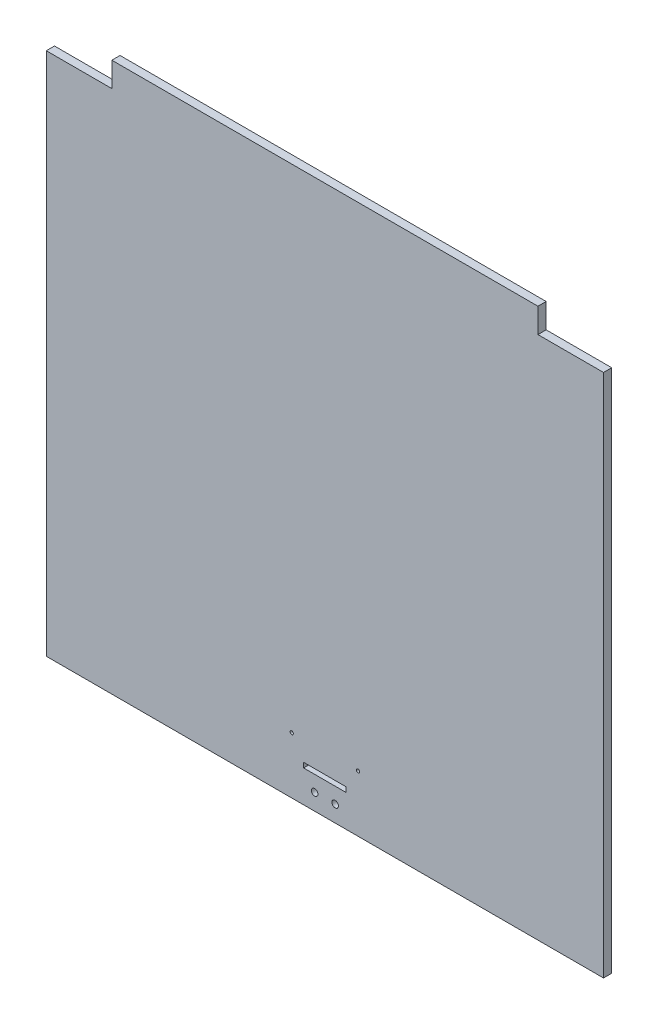
ISO-10303-21;
HEADER;
FILE_DESCRIPTION(('STEP AP214'),'2;1');
FILE_NAME('part.step','',(''),(''),'','','');
FILE_SCHEMA(('AUTOMOTIVE_DESIGN { 1 0 10303 214 1 1 1 1 }'));
ENDSEC;
DATA;
#1=APPLICATION_CONTEXT('core data for automotive mechanical design processes');
#2=APPLICATION_PROTOCOL_DEFINITION('international standard','automotive_design',2000,#1);
#3=PRODUCT_CONTEXT('',#1,'mechanical');
#4=PRODUCT('Part','Part','',(#3));
#5=PRODUCT_RELATED_PRODUCT_CATEGORY('part','',(#4));
#6=PRODUCT_DEFINITION_FORMATION('','',#4);
#7=PRODUCT_DEFINITION_CONTEXT('part definition',#1,'design');
#8=PRODUCT_DEFINITION('design','',#6,#7);
#9=PRODUCT_DEFINITION_SHAPE('','',#8);
#10=(LENGTH_UNIT() NAMED_UNIT(*) SI_UNIT(.MILLI.,.METRE.));
#11=(NAMED_UNIT(*) PLANE_ANGLE_UNIT() SI_UNIT($,.RADIAN.));
#12=(NAMED_UNIT(*) SI_UNIT($,.STERADIAN.) SOLID_ANGLE_UNIT());
#13=UNCERTAINTY_MEASURE_WITH_UNIT(LENGTH_MEASURE(1.E-05),#10,'distance_accuracy_value','');
#14=(GEOMETRIC_REPRESENTATION_CONTEXT(3) GLOBAL_UNCERTAINTY_ASSIGNED_CONTEXT((#13)) GLOBAL_UNIT_ASSIGNED_CONTEXT((#10,
#11,#12)) REPRESENTATION_CONTEXT('',''));
#15=CARTESIAN_POINT('',(0.,0.,0.));
#16=DIRECTION('',(0.,0.,1.));
#17=DIRECTION('',(1.,0.,0.));
#18=AXIS2_PLACEMENT_3D('',#15,#16,#17);
#19=CARTESIAN_POINT('',(-340.,335.,10.));
#20=DIRECTION('',(1.,0.,0.));
#21=DIRECTION('',(0.,1.,0.));
#22=AXIS2_PLACEMENT_3D('',#19,#20,#21);
#23=PLANE('',#22);
#24=DIRECTION('',(0.,-1.,0.));
#25=VECTOR('',#24,1.);
#26=CARTESIAN_POINT('',(-340.,335.,10.));
#27=LINE('',#26,#25);
#28=CARTESIAN_POINT('',(-340.,305.,10.));
#29=VERTEX_POINT('',#28);
#30=CARTESIAN_POINT('',(-340.,-335.,10.));
#31=VERTEX_POINT('',#30);
#32=EDGE_CURVE('E199',#29,#31,#27,.T.);
#33=ORIENTED_EDGE('',*,*,#32,.F.);
#34=DIRECTION('',(0.,0.,1.));
#35=VECTOR('',#34,1.);
#36=CARTESIAN_POINT('',(-340.,305.,0.));
#37=LINE('',#36,#35);
#38=CARTESIAN_POINT('',(-340.,305.,0.));
#39=VERTEX_POINT('',#38);
#40=EDGE_CURVE('E187',#39,#29,#37,.T.);
#41=ORIENTED_EDGE('',*,*,#40,.F.);
#42=DIRECTION('',(0.,-1.,0.));
#43=VECTOR('',#42,1.);
#44=CARTESIAN_POINT('',(-340.,335.,0.));
#45=LINE('',#44,#43);
#46=CARTESIAN_POINT('',(-340.,-335.,0.));
#47=VERTEX_POINT('',#46);
#48=EDGE_CURVE('E195',#39,#47,#45,.T.);
#49=ORIENTED_EDGE('',*,*,#48,.T.);
#50=DIRECTION('',(0.,0.,-1.));
#51=VECTOR('',#50,1.);
#52=CARTESIAN_POINT('',(-340.,-335.,10.));
#53=LINE('',#52,#51);
#54=EDGE_CURVE('E11',#31,#47,#53,.T.);
#55=ORIENTED_EDGE('',*,*,#54,.F.);
#56=EDGE_LOOP('',(#33,#41,#49,#55));
#57=FACE_BOUND('',#56,.T.);
#58=ADVANCED_FACE('F33',(#57),#23,.F.);
#59=CARTESIAN_POINT('',(-340.,-335.,10.));
#60=DIRECTION('',(0.,1.,0.));
#61=DIRECTION('',(0.,0.,1.));
#62=AXIS2_PLACEMENT_3D('',#59,#60,#61);
#63=PLANE('',#62);
#64=DIRECTION('',(1.,0.,0.));
#65=VECTOR('',#64,1.);
#66=CARTESIAN_POINT('',(-340.,-335.,0.));
#67=LINE('',#66,#65);
#68=CARTESIAN_POINT('',(340.,-335.,0.));
#69=VERTEX_POINT('',#68);
#70=EDGE_CURVE('E210',#47,#69,#67,.T.);
#71=ORIENTED_EDGE('',*,*,#70,.T.);
#72=DIRECTION('',(0.,0.,-1.));
#73=VECTOR('',#72,1.);
#74=CARTESIAN_POINT('',(340.,-335.,10.));
#75=LINE('',#74,#73);
#76=CARTESIAN_POINT('',(340.,-335.,10.));
#77=VERTEX_POINT('',#76);
#78=EDGE_CURVE('E40',#77,#69,#75,.T.);
#79=ORIENTED_EDGE('',*,*,#78,.F.);
#80=DIRECTION('',(1.,0.,0.));
#81=VECTOR('',#80,1.);
#82=CARTESIAN_POINT('',(-340.,-335.,10.));
#83=LINE('',#82,#81);
#84=EDGE_CURVE('E201',#31,#77,#83,.T.);
#85=ORIENTED_EDGE('',*,*,#84,.F.);
#86=ORIENTED_EDGE('',*,*,#54,.T.);
#87=EDGE_LOOP('',(#71,#79,#85,#86));
#88=FACE_BOUND('',#87,.T.);
#89=ADVANCED_FACE('F240',(#88),#63,.F.);
#90=CARTESIAN_POINT('',(340.,335.,10.));
#91=DIRECTION('',(-1.,0.,0.));
#92=DIRECTION('',(0.,-1.,0.));
#93=AXIS2_PLACEMENT_3D('',#90,#91,#92);
#94=PLANE('',#93);
#95=DIRECTION('',(0.,1.,0.));
#96=VECTOR('',#95,1.);
#97=CARTESIAN_POINT('',(340.,335.,0.));
#98=LINE('',#97,#96);
#99=CARTESIAN_POINT('',(340.,305.,0.));
#100=VERTEX_POINT('',#99);
#101=EDGE_CURVE('E212',#69,#100,#98,.T.);
#102=ORIENTED_EDGE('',*,*,#101,.T.);
#103=DIRECTION('',(0.,0.,1.));
#104=VECTOR('',#103,1.);
#105=CARTESIAN_POINT('',(340.,305.,0.));
#106=LINE('',#105,#104);
#107=CARTESIAN_POINT('',(340.,305.,10.));
#108=VERTEX_POINT('',#107);
#109=EDGE_CURVE('E173',#100,#108,#106,.T.);
#110=ORIENTED_EDGE('',*,*,#109,.T.);
#111=DIRECTION('',(0.,1.,0.));
#112=VECTOR('',#111,1.);
#113=CARTESIAN_POINT('',(340.,335.,10.));
#114=LINE('',#113,#112);
#115=EDGE_CURVE('E204',#77,#108,#114,.T.);
#116=ORIENTED_EDGE('',*,*,#115,.F.);
#117=ORIENTED_EDGE('',*,*,#78,.T.);
#118=EDGE_LOOP('',(#102,#110,#116,#117));
#119=FACE_BOUND('',#118,.T.);
#120=ADVANCED_FACE('F220',(#119),#94,.F.);
#121=CARTESIAN_POINT('',(-340.,335.,10.));
#122=DIRECTION('',(0.,-1.,0.));
#123=DIRECTION('',(1.,0.,0.));
#124=AXIS2_PLACEMENT_3D('',#121,#122,#123);
#125=PLANE('',#124);
#126=DIRECTION('',(-1.,0.,0.));
#127=VECTOR('',#126,1.);
#128=CARTESIAN_POINT('',(-340.,335.,10.));
#129=LINE('',#128,#127);
#130=CARTESIAN_POINT('',(260.,335.,10.));
#131=VERTEX_POINT('',#130);
#132=CARTESIAN_POINT('',(-260.,335.,10.));
#133=VERTEX_POINT('',#132);
#134=EDGE_CURVE('E207',#131,#133,#129,.T.);
#135=ORIENTED_EDGE('',*,*,#134,.F.);
#136=DIRECTION('',(0.,0.,1.));
#137=VECTOR('',#136,1.);
#138=CARTESIAN_POINT('',(260.,335.,0.));
#139=LINE('',#138,#137);
#140=CARTESIAN_POINT('',(260.,335.,0.));
#141=VERTEX_POINT('',#140);
#142=EDGE_CURVE('E169',#141,#131,#139,.T.);
#143=ORIENTED_EDGE('',*,*,#142,.F.);
#144=DIRECTION('',(-1.,0.,0.));
#145=VECTOR('',#144,1.);
#146=CARTESIAN_POINT('',(-340.,335.,0.));
#147=LINE('',#146,#145);
#148=CARTESIAN_POINT('',(-260.,335.,0.));
#149=VERTEX_POINT('',#148);
#150=EDGE_CURVE('E202',#141,#149,#147,.T.);
#151=ORIENTED_EDGE('',*,*,#150,.T.);
#152=DIRECTION('',(0.,0.,1.));
#153=VECTOR('',#152,1.);
#154=CARTESIAN_POINT('',(-260.,335.,0.));
#155=LINE('',#154,#153);
#156=EDGE_CURVE('E192',#149,#133,#155,.T.);
#157=ORIENTED_EDGE('',*,*,#156,.T.);
#158=EDGE_LOOP('',(#135,#143,#151,#157));
#159=FACE_BOUND('',#158,.T.);
#160=ADVANCED_FACE('F251',(#159),#125,.F.);
#161=CARTESIAN_POINT('',(0.,0.,10.));
#162=DIRECTION('',(0.,0.,1.));
#163=DIRECTION('',(1.,0.,0.));
#164=AXIS2_PLACEMENT_3D('',#161,#162,#163);
#165=PLANE('',#164);
#166=CARTESIAN_POINT('',(40.5,-266.,10.));
#167=DIRECTION('',(0.,0.,1.));
#168=DIRECTION('',(1.,0.,0.));
#169=AXIS2_PLACEMENT_3D('',#166,#167,#168);
#170=CIRCLE('',#169,2.);
#171=CARTESIAN_POINT('',(42.5,-266.,10.));
#172=VERTEX_POINT('',#171);
#173=EDGE_CURVE('E409',#172,#172,#170,.T.);
#174=ORIENTED_EDGE('',*,*,#173,.F.);
#175=EDGE_LOOP('',(#174));
#176=FACE_BOUND('',#175,.T.);
#177=CARTESIAN_POINT('',(-40.5,-266.,10.));
#178=DIRECTION('',(0.,0.,1.));
#179=DIRECTION('',(1.,0.,0.));
#180=AXIS2_PLACEMENT_3D('',#177,#178,#179);
#181=CIRCLE('',#180,2.);
#182=CARTESIAN_POINT('',(-38.5,-266.,10.));
#183=VERTEX_POINT('',#182);
#184=EDGE_CURVE('E411',#183,#183,#181,.T.);
#185=ORIENTED_EDGE('',*,*,#184,.F.);
#186=EDGE_LOOP('',(#185));
#187=FACE_BOUND('',#186,.T.);
#188=CARTESIAN_POINT('',(12.5,-315.,10.));
#189=DIRECTION('',(0.,0.,1.));
#190=DIRECTION('',(1.,0.,0.));
#191=AXIS2_PLACEMENT_3D('',#188,#189,#190);
#192=CIRCLE('',#191,4.);
#193=CARTESIAN_POINT('',(16.5,-315.,10.));
#194=VERTEX_POINT('',#193);
#195=EDGE_CURVE('E417',#194,#194,#192,.T.);
#196=ORIENTED_EDGE('',*,*,#195,.F.);
#197=EDGE_LOOP('',(#196));
#198=FACE_BOUND('',#197,.T.);
#199=CARTESIAN_POINT('',(-12.5,-315.,10.));
#200=DIRECTION('',(0.,0.,1.));
#201=DIRECTION('',(1.,0.,0.));
#202=AXIS2_PLACEMENT_3D('',#199,#200,#201);
#203=CIRCLE('',#202,4.);
#204=CARTESIAN_POINT('',(-8.50000000000001,-315.,10.));
#205=VERTEX_POINT('',#204);
#206=EDGE_CURVE('E145',#205,#205,#203,.T.);
#207=ORIENTED_EDGE('',*,*,#206,.F.);
#208=EDGE_LOOP('',(#207));
#209=FACE_BOUND('',#208,.T.);
#210=DIRECTION('',(0.,-1.,0.));
#211=VECTOR('',#210,1.);
#212=CARTESIAN_POINT('',(-25.9999999999999,-290.,10.));
#213=LINE('',#212,#211);
#214=CARTESIAN_POINT('',(-25.9999999999999,-290.,10.));
#215=VERTEX_POINT('',#214);
#216=CARTESIAN_POINT('',(-25.9999999999999,-296.,10.));
#217=VERTEX_POINT('',#216);
#218=EDGE_CURVE('E47',#215,#217,#213,.T.);
#219=ORIENTED_EDGE('',*,*,#218,.F.);
#220=DIRECTION('',(-1.,0.,0.));
#221=VECTOR('',#220,1.);
#222=CARTESIAN_POINT('',(-25.9999999999999,-290.,10.));
#223=LINE('',#222,#221);
#224=CARTESIAN_POINT('',(26.0000000000001,-290.,10.));
#225=VERTEX_POINT('',#224);
#226=EDGE_CURVE('E139',#225,#215,#223,.T.);
#227=ORIENTED_EDGE('',*,*,#226,.F.);
#228=DIRECTION('',(0.,1.,0.));
#229=VECTOR('',#228,1.);
#230=CARTESIAN_POINT('',(26.0000000000001,-290.,10.));
#231=LINE('',#230,#229);
#232=CARTESIAN_POINT('',(26.0000000000001,-296.,10.));
#233=VERTEX_POINT('',#232);
#234=EDGE_CURVE('E142',#233,#225,#231,.T.);
#235=ORIENTED_EDGE('',*,*,#234,.F.);
#236=DIRECTION('',(1.,0.,0.));
#237=VECTOR('',#236,1.);
#238=CARTESIAN_POINT('',(-25.9999999999999,-296.,10.));
#239=LINE('',#238,#237);
#240=EDGE_CURVE('E151',#217,#233,#239,.T.);
#241=ORIENTED_EDGE('',*,*,#240,.F.);
#242=EDGE_LOOP('',(#219,#227,#235,#241));
#243=FACE_BOUND('',#242,.T.);
#244=DIRECTION('',(1.,0.,0.));
#245=VECTOR('',#244,1.);
#246=CARTESIAN_POINT('',(340.,305.,10.));
#247=LINE('',#246,#245);
#248=CARTESIAN_POINT('',(260.,305.,10.));
#249=VERTEX_POINT('',#248);
#250=EDGE_CURVE('E166',#249,#108,#247,.T.);
#251=ORIENTED_EDGE('',*,*,#250,.F.);
#252=DIRECTION('',(0.,-1.,0.));
#253=VECTOR('',#252,1.);
#254=CARTESIAN_POINT('',(260.,335.,10.));
#255=LINE('',#254,#253);
#256=EDGE_CURVE('E158',#131,#249,#255,.T.);
#257=ORIENTED_EDGE('',*,*,#256,.F.);
#258=ORIENTED_EDGE('',*,*,#134,.T.);
#259=DIRECTION('',(0.,1.,0.));
#260=VECTOR('',#259,1.);
#261=CARTESIAN_POINT('',(-260.,335.,10.));
#262=LINE('',#261,#260);
#263=CARTESIAN_POINT('',(-260.,305.,10.));
#264=VERTEX_POINT('',#263);
#265=EDGE_CURVE('E184',#264,#133,#262,.T.);
#266=ORIENTED_EDGE('',*,*,#265,.F.);
#267=DIRECTION('',(1.,0.,0.));
#268=VECTOR('',#267,1.);
#269=CARTESIAN_POINT('',(-340.,305.,10.));
#270=LINE('',#269,#268);
#271=EDGE_CURVE('E176',#29,#264,#270,.T.);
#272=ORIENTED_EDGE('',*,*,#271,.F.);
#273=ORIENTED_EDGE('',*,*,#32,.T.);
#274=ORIENTED_EDGE('',*,*,#84,.T.);
#275=ORIENTED_EDGE('',*,*,#115,.T.);
#276=EDGE_LOOP('',(#251,#257,#258,#266,#272,#273,#274,#275));
#277=FACE_BOUND('',#276,.T.);
#278=ADVANCED_FACE('F236',(#176,#187,#198,#209,#243,#277),#165,.T.);
#279=CARTESIAN_POINT('',(0.,0.,0.));
#280=DIRECTION('',(0.,0.,1.));
#281=DIRECTION('',(1.,0.,0.));
#282=AXIS2_PLACEMENT_3D('',#279,#280,#281);
#283=PLANE('',#282);
#284=CARTESIAN_POINT('',(40.5,-266.,0.));
#285=DIRECTION('',(0.,0.,1.));
#286=DIRECTION('',(1.,0.,0.));
#287=AXIS2_PLACEMENT_3D('',#284,#285,#286);
#288=CIRCLE('',#287,2.);
#289=CARTESIAN_POINT('',(42.5,-266.,0.));
#290=VERTEX_POINT('',#289);
#291=EDGE_CURVE('E406',#290,#290,#288,.T.);
#292=ORIENTED_EDGE('',*,*,#291,.T.);
#293=EDGE_LOOP('',(#292));
#294=FACE_BOUND('',#293,.T.);
#295=CARTESIAN_POINT('',(-40.5,-266.,0.));
#296=DIRECTION('',(0.,0.,1.));
#297=DIRECTION('',(1.,0.,0.));
#298=AXIS2_PLACEMENT_3D('',#295,#296,#297);
#299=CIRCLE('',#298,2.);
#300=CARTESIAN_POINT('',(-38.5,-266.,0.));
#301=VERTEX_POINT('',#300);
#302=EDGE_CURVE('E414',#301,#301,#299,.T.);
#303=ORIENTED_EDGE('',*,*,#302,.T.);
#304=EDGE_LOOP('',(#303));
#305=FACE_BOUND('',#304,.T.);
#306=CARTESIAN_POINT('',(12.5,-315.,0.));
#307=DIRECTION('',(0.,0.,1.));
#308=DIRECTION('',(1.,0.,0.));
#309=AXIS2_PLACEMENT_3D('',#306,#307,#308);
#310=CIRCLE('',#309,4.);
#311=CARTESIAN_POINT('',(16.5,-315.,0.));
#312=VERTEX_POINT('',#311);
#313=EDGE_CURVE('E420',#312,#312,#310,.T.);
#314=ORIENTED_EDGE('',*,*,#313,.T.);
#315=EDGE_LOOP('',(#314));
#316=FACE_BOUND('',#315,.T.);
#317=CARTESIAN_POINT('',(-12.5,-315.,0.));
#318=DIRECTION('',(0.,0.,1.));
#319=DIRECTION('',(1.,0.,0.));
#320=AXIS2_PLACEMENT_3D('',#317,#318,#319);
#321=CIRCLE('',#320,4.);
#322=CARTESIAN_POINT('',(-8.50000000000001,-315.,0.));
#323=VERTEX_POINT('',#322);
#324=EDGE_CURVE('E152',#323,#323,#321,.T.);
#325=ORIENTED_EDGE('',*,*,#324,.T.);
#326=EDGE_LOOP('',(#325));
#327=FACE_BOUND('',#326,.T.);
#328=DIRECTION('',(-1.,0.,0.));
#329=VECTOR('',#328,1.);
#330=CARTESIAN_POINT('',(-25.9999999999999,-290.,0.));
#331=LINE('',#330,#329);
#332=CARTESIAN_POINT('',(26.0000000000001,-290.,0.));
#333=VERTEX_POINT('',#332);
#334=CARTESIAN_POINT('',(-25.9999999999999,-290.,0.));
#335=VERTEX_POINT('',#334);
#336=EDGE_CURVE('E129',#333,#335,#331,.T.);
#337=ORIENTED_EDGE('',*,*,#336,.T.);
#338=DIRECTION('',(0.,-1.,0.));
#339=VECTOR('',#338,1.);
#340=CARTESIAN_POINT('',(-25.9999999999999,-290.,0.));
#341=LINE('',#340,#339);
#342=CARTESIAN_POINT('',(-25.9999999999999,-296.,0.));
#343=VERTEX_POINT('',#342);
#344=EDGE_CURVE('E123',#335,#343,#341,.T.);
#345=ORIENTED_EDGE('',*,*,#344,.T.);
#346=DIRECTION('',(1.,0.,0.));
#347=VECTOR('',#346,1.);
#348=CARTESIAN_POINT('',(-25.9999999999999,-296.,0.));
#349=LINE('',#348,#347);
#350=CARTESIAN_POINT('',(26.0000000000001,-296.,0.));
#351=VERTEX_POINT('',#350);
#352=EDGE_CURVE('E132',#343,#351,#349,.T.);
#353=ORIENTED_EDGE('',*,*,#352,.T.);
#354=DIRECTION('',(0.,1.,0.));
#355=VECTOR('',#354,1.);
#356=CARTESIAN_POINT('',(26.0000000000001,-290.,0.));
#357=LINE('',#356,#355);
#358=EDGE_CURVE('E55',#351,#333,#357,.T.);
#359=ORIENTED_EDGE('',*,*,#358,.T.);
#360=EDGE_LOOP('',(#337,#345,#353,#359));
#361=FACE_BOUND('',#360,.T.);
#362=DIRECTION('',(0.,-1.,0.));
#363=VECTOR('',#362,1.);
#364=CARTESIAN_POINT('',(260.,335.,0.));
#365=LINE('',#364,#363);
#366=CARTESIAN_POINT('',(260.,305.,0.));
#367=VERTEX_POINT('',#366);
#368=EDGE_CURVE('E162',#141,#367,#365,.T.);
#369=ORIENTED_EDGE('',*,*,#368,.T.);
#370=DIRECTION('',(1.,0.,0.));
#371=VECTOR('',#370,1.);
#372=CARTESIAN_POINT('',(340.,305.,0.));
#373=LINE('',#372,#371);
#374=EDGE_CURVE('E165',#367,#100,#373,.T.);
#375=ORIENTED_EDGE('',*,*,#374,.T.);
#376=ORIENTED_EDGE('',*,*,#101,.F.);
#377=ORIENTED_EDGE('',*,*,#70,.F.);
#378=ORIENTED_EDGE('',*,*,#48,.F.);
#379=DIRECTION('',(1.,0.,0.));
#380=VECTOR('',#379,1.);
#381=CARTESIAN_POINT('',(-340.,305.,0.));
#382=LINE('',#381,#380);
#383=CARTESIAN_POINT('',(-260.,305.,0.));
#384=VERTEX_POINT('',#383);
#385=EDGE_CURVE('E180',#39,#384,#382,.T.);
#386=ORIENTED_EDGE('',*,*,#385,.T.);
#387=DIRECTION('',(0.,1.,0.));
#388=VECTOR('',#387,1.);
#389=CARTESIAN_POINT('',(-260.,335.,0.));
#390=LINE('',#389,#388);
#391=EDGE_CURVE('E183',#384,#149,#390,.T.);
#392=ORIENTED_EDGE('',*,*,#391,.T.);
#393=ORIENTED_EDGE('',*,*,#150,.F.);
#394=EDGE_LOOP('',(#369,#375,#376,#377,#378,#386,#392,#393));
#395=FACE_BOUND('',#394,.T.);
#396=ADVANCED_FACE('F136',(#294,#305,#316,#327,#361,#395),#283,.F.);
#397=CARTESIAN_POINT('',(-260.,335.,0.));
#398=DIRECTION('',(1.,0.,0.));
#399=DIRECTION('',(0.,0.,-1.));
#400=AXIS2_PLACEMENT_3D('',#397,#398,#399);
#401=PLANE('',#400);
#402=ORIENTED_EDGE('',*,*,#265,.T.);
#403=ORIENTED_EDGE('',*,*,#156,.F.);
#404=ORIENTED_EDGE('',*,*,#391,.F.);
#405=DIRECTION('',(0.,0.,1.));
#406=VECTOR('',#405,1.);
#407=CARTESIAN_POINT('',(-260.,305.,0.));
#408=LINE('',#407,#406);
#409=EDGE_CURVE('E196',#384,#264,#408,.T.);
#410=ORIENTED_EDGE('',*,*,#409,.T.);
#411=EDGE_LOOP('',(#402,#403,#404,#410));
#412=FACE_BOUND('',#411,.T.);
#413=ADVANCED_FACE('F248',(#412),#401,.F.);
#414=CARTESIAN_POINT('',(-340.,305.,0.));
#415=DIRECTION('',(0.,-1.,0.));
#416=DIRECTION('',(0.,0.,-1.));
#417=AXIS2_PLACEMENT_3D('',#414,#415,#416);
#418=PLANE('',#417);
#419=ORIENTED_EDGE('',*,*,#271,.T.);
#420=ORIENTED_EDGE('',*,*,#409,.F.);
#421=ORIENTED_EDGE('',*,*,#385,.F.);
#422=ORIENTED_EDGE('',*,*,#40,.T.);
#423=EDGE_LOOP('',(#419,#420,#421,#422));
#424=FACE_BOUND('',#423,.T.);
#425=ADVANCED_FACE('F245',(#424),#418,.F.);
#426=CARTESIAN_POINT('',(340.,305.,0.));
#427=DIRECTION('',(0.,-1.,0.));
#428=DIRECTION('',(0.,0.,-1.));
#429=AXIS2_PLACEMENT_3D('',#426,#427,#428);
#430=PLANE('',#429);
#431=ORIENTED_EDGE('',*,*,#250,.T.);
#432=ORIENTED_EDGE('',*,*,#109,.F.);
#433=ORIENTED_EDGE('',*,*,#374,.F.);
#434=DIRECTION('',(0.,0.,1.));
#435=VECTOR('',#434,1.);
#436=CARTESIAN_POINT('',(260.,305.,0.));
#437=LINE('',#436,#435);
#438=EDGE_CURVE('E177',#367,#249,#437,.T.);
#439=ORIENTED_EDGE('',*,*,#438,.T.);
#440=EDGE_LOOP('',(#431,#432,#433,#439));
#441=FACE_BOUND('',#440,.T.);
#442=ADVANCED_FACE('F228',(#441),#430,.F.);
#443=CARTESIAN_POINT('',(260.,335.,0.));
#444=DIRECTION('',(-1.,0.,0.));
#445=DIRECTION('',(0.,-1.,0.));
#446=AXIS2_PLACEMENT_3D('',#443,#444,#445);
#447=PLANE('',#446);
#448=ORIENTED_EDGE('',*,*,#256,.T.);
#449=ORIENTED_EDGE('',*,*,#438,.F.);
#450=ORIENTED_EDGE('',*,*,#368,.F.);
#451=ORIENTED_EDGE('',*,*,#142,.T.);
#452=EDGE_LOOP('',(#448,#449,#450,#451));
#453=FACE_BOUND('',#452,.T.);
#454=ADVANCED_FACE('F230',(#453),#447,.F.);
#455=CARTESIAN_POINT('',(-25.9999999999999,-290.,0.));
#456=DIRECTION('',(-1.,0.,0.));
#457=DIRECTION('',(0.,0.,1.));
#458=AXIS2_PLACEMENT_3D('',#455,#456,#457);
#459=PLANE('',#458);
#460=ORIENTED_EDGE('',*,*,#218,.T.);
#461=DIRECTION('',(0.,0.,1.));
#462=VECTOR('',#461,1.);
#463=CARTESIAN_POINT('',(-25.9999999999999,-296.,0.));
#464=LINE('',#463,#462);
#465=EDGE_CURVE('E119',#343,#217,#464,.T.);
#466=ORIENTED_EDGE('',*,*,#465,.F.);
#467=ORIENTED_EDGE('',*,*,#344,.F.);
#468=DIRECTION('',(0.,0.,1.));
#469=VECTOR('',#468,1.);
#470=CARTESIAN_POINT('',(-25.9999999999999,-290.,0.));
#471=LINE('',#470,#469);
#472=EDGE_CURVE('E156',#335,#215,#471,.T.);
#473=ORIENTED_EDGE('',*,*,#472,.T.);
#474=EDGE_LOOP('',(#460,#466,#467,#473));
#475=FACE_BOUND('',#474,.T.);
#476=ADVANCED_FACE('F121',(#475),#459,.F.);
#477=CARTESIAN_POINT('',(-25.9999999999999,-290.,0.));
#478=DIRECTION('',(0.,1.,0.));
#479=DIRECTION('',(0.,0.,1.));
#480=AXIS2_PLACEMENT_3D('',#477,#478,#479);
#481=PLANE('',#480);
#482=ORIENTED_EDGE('',*,*,#226,.T.);
#483=ORIENTED_EDGE('',*,*,#472,.F.);
#484=ORIENTED_EDGE('',*,*,#336,.F.);
#485=DIRECTION('',(0.,0.,1.));
#486=VECTOR('',#485,1.);
#487=CARTESIAN_POINT('',(26.0000000000001,-290.,0.));
#488=LINE('',#487,#486);
#489=EDGE_CURVE('E159',#333,#225,#488,.T.);
#490=ORIENTED_EDGE('',*,*,#489,.T.);
#491=EDGE_LOOP('',(#482,#483,#484,#490));
#492=FACE_BOUND('',#491,.T.);
#493=ADVANCED_FACE('F326',(#492),#481,.F.);
#494=CARTESIAN_POINT('',(26.0000000000001,-290.,0.));
#495=DIRECTION('',(1.,0.,0.));
#496=DIRECTION('',(0.,1.,0.));
#497=AXIS2_PLACEMENT_3D('',#494,#495,#496);
#498=PLANE('',#497);
#499=ORIENTED_EDGE('',*,*,#234,.T.);
#500=ORIENTED_EDGE('',*,*,#489,.F.);
#501=ORIENTED_EDGE('',*,*,#358,.F.);
#502=DIRECTION('',(0.,0.,1.));
#503=VECTOR('',#502,1.);
#504=CARTESIAN_POINT('',(26.0000000000001,-296.,0.));
#505=LINE('',#504,#503);
#506=EDGE_CURVE('E128',#351,#233,#505,.T.);
#507=ORIENTED_EDGE('',*,*,#506,.T.);
#508=EDGE_LOOP('',(#499,#500,#501,#507));
#509=FACE_BOUND('',#508,.T.);
#510=ADVANCED_FACE('F333',(#509),#498,.F.);
#511=CARTESIAN_POINT('',(-25.9999999999999,-296.,0.));
#512=DIRECTION('',(0.,-1.,0.));
#513=DIRECTION('',(0.,0.,-1.));
#514=AXIS2_PLACEMENT_3D('',#511,#512,#513);
#515=PLANE('',#514);
#516=ORIENTED_EDGE('',*,*,#240,.T.);
#517=ORIENTED_EDGE('',*,*,#506,.F.);
#518=ORIENTED_EDGE('',*,*,#352,.F.);
#519=ORIENTED_EDGE('',*,*,#465,.T.);
#520=EDGE_LOOP('',(#516,#517,#518,#519));
#521=FACE_BOUND('',#520,.T.);
#522=ADVANCED_FACE('F133',(#521),#515,.F.);
#523=CARTESIAN_POINT('',(-12.5,-315.,0.));
#524=DIRECTION('',(0.,0.,1.));
#525=DIRECTION('',(1.,0.,0.));
#526=AXIS2_PLACEMENT_3D('',#523,#524,#525);
#527=CYLINDRICAL_SURFACE('',#526,4.);
#528=ORIENTED_EDGE('',*,*,#324,.F.);
#529=EDGE_LOOP('',(#528));
#530=FACE_BOUND('',#529,.T.);
#531=ORIENTED_EDGE('',*,*,#206,.T.);
#532=EDGE_LOOP('',(#531));
#533=FACE_BOUND('',#532,.T.);
#534=ADVANCED_FACE('F347',(#530,#533),#527,.F.);
#535=CARTESIAN_POINT('',(12.5,-315.,0.));
#536=DIRECTION('',(0.,0.,1.));
#537=DIRECTION('',(1.,0.,0.));
#538=AXIS2_PLACEMENT_3D('',#535,#536,#537);
#539=CYLINDRICAL_SURFACE('',#538,4.);
#540=ORIENTED_EDGE('',*,*,#313,.F.);
#541=EDGE_LOOP('',(#540));
#542=FACE_BOUND('',#541,.T.);
#543=ORIENTED_EDGE('',*,*,#195,.T.);
#544=EDGE_LOOP('',(#543));
#545=FACE_BOUND('',#544,.T.);
#546=ADVANCED_FACE('F354',(#542,#545),#539,.F.);
#547=CARTESIAN_POINT('',(-40.5,-266.,0.));
#548=DIRECTION('',(0.,0.,1.));
#549=DIRECTION('',(1.,0.,0.));
#550=AXIS2_PLACEMENT_3D('',#547,#548,#549);
#551=CYLINDRICAL_SURFACE('',#550,2.);
#552=ORIENTED_EDGE('',*,*,#302,.F.);
#553=EDGE_LOOP('',(#552));
#554=FACE_BOUND('',#553,.T.);
#555=ORIENTED_EDGE('',*,*,#184,.T.);
#556=EDGE_LOOP('',(#555));
#557=FACE_BOUND('',#556,.T.);
#558=ADVANCED_FACE('F361',(#554,#557),#551,.F.);
#559=CARTESIAN_POINT('',(40.5,-266.,0.));
#560=DIRECTION('',(0.,0.,1.));
#561=DIRECTION('',(1.,0.,0.));
#562=AXIS2_PLACEMENT_3D('',#559,#560,#561);
#563=CYLINDRICAL_SURFACE('',#562,2.);
#564=ORIENTED_EDGE('',*,*,#291,.F.);
#565=EDGE_LOOP('',(#564));
#566=FACE_BOUND('',#565,.T.);
#567=ORIENTED_EDGE('',*,*,#173,.T.);
#568=EDGE_LOOP('',(#567));
#569=FACE_BOUND('',#568,.T.);
#570=ADVANCED_FACE('F368',(#566,#569),#563,.F.);
#571=CLOSED_SHELL('',(#58,#89,#120,#160,#278,#396,#413,#425,#442,#454,#476,#493,#510,#522,#534,
#546,#558,#570));
#572=MANIFOLD_SOLID_BREP('B2',#571);
#573=ADVANCED_BREP_SHAPE_REPRESENTATION('',(#18,#572),#14);
#574=SHAPE_DEFINITION_REPRESENTATION(#9,#573);
ENDSEC;
END-ISO-10303-21;
